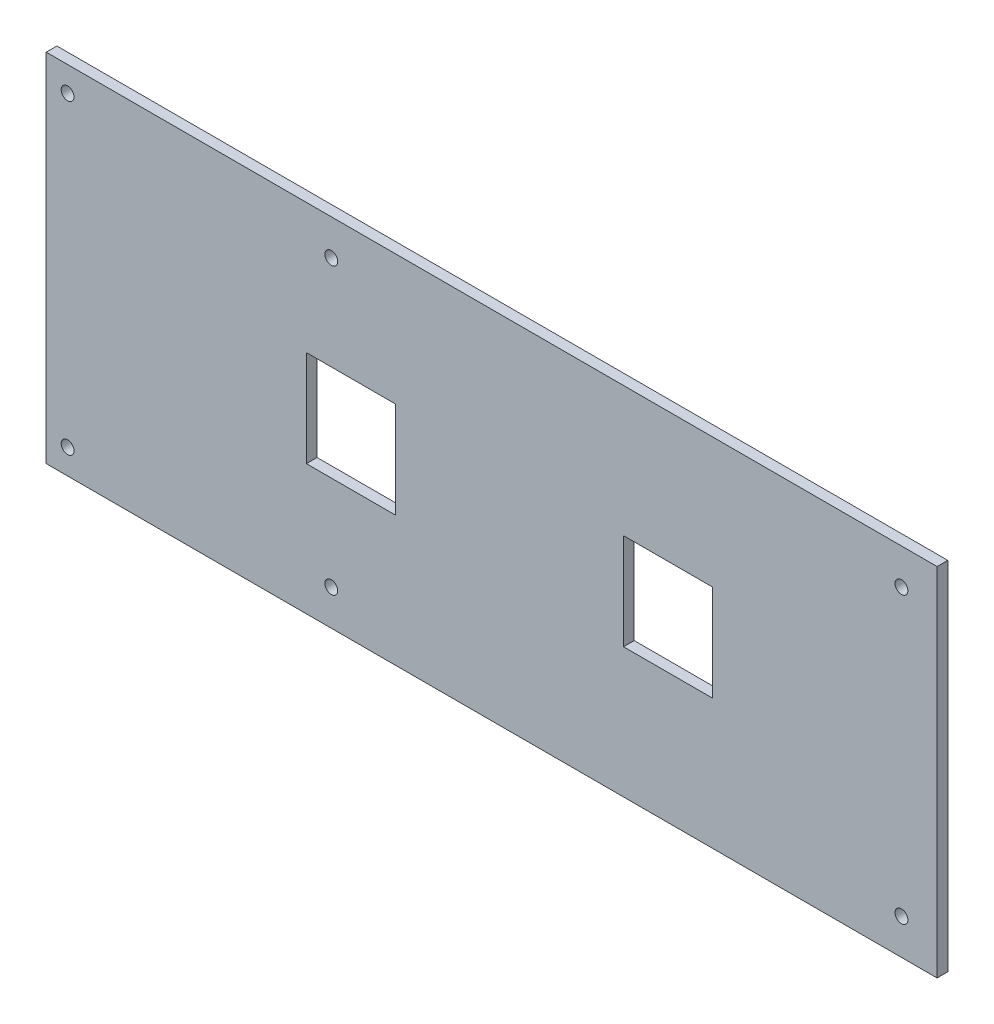
ISO-10303-21;
HEADER;
FILE_DESCRIPTION(('STEP AP214'),'2;1');
FILE_NAME('part.step','',(''),(''),'','','');
FILE_SCHEMA(('AUTOMOTIVE_DESIGN { 1 0 10303 214 1 1 1 1 }'));
ENDSEC;
DATA;
#1=APPLICATION_CONTEXT('core data for automotive mechanical design processes');
#2=APPLICATION_PROTOCOL_DEFINITION('international standard','automotive_design',2000,#1);
#3=PRODUCT_CONTEXT('',#1,'mechanical');
#4=PRODUCT('Part','Part','',(#3));
#5=PRODUCT_RELATED_PRODUCT_CATEGORY('part','',(#4));
#6=PRODUCT_DEFINITION_FORMATION('','',#4);
#7=PRODUCT_DEFINITION_CONTEXT('part definition',#1,'design');
#8=PRODUCT_DEFINITION('design','',#6,#7);
#9=PRODUCT_DEFINITION_SHAPE('','',#8);
#10=(LENGTH_UNIT() NAMED_UNIT(*) SI_UNIT(.MILLI.,.METRE.));
#11=(NAMED_UNIT(*) PLANE_ANGLE_UNIT() SI_UNIT($,.RADIAN.));
#12=(NAMED_UNIT(*) SI_UNIT($,.STERADIAN.) SOLID_ANGLE_UNIT());
#13=UNCERTAINTY_MEASURE_WITH_UNIT(LENGTH_MEASURE(1.E-05),#10,'distance_accuracy_value','');
#14=(GEOMETRIC_REPRESENTATION_CONTEXT(3) GLOBAL_UNCERTAINTY_ASSIGNED_CONTEXT((#13)) GLOBAL_UNIT_ASSIGNED_CONTEXT((#10,
#11,#12)) REPRESENTATION_CONTEXT('',''));
#15=CARTESIAN_POINT('',(0.,0.,0.));
#16=DIRECTION('',(0.,0.,1.));
#17=DIRECTION('',(1.,0.,0.));
#18=AXIS2_PLACEMENT_3D('',#15,#16,#17);
#19=CARTESIAN_POINT('',(0.,0.,3.));
#20=DIRECTION('',(1.,0.,0.));
#21=DIRECTION('',(0.,0.,-1.));
#22=AXIS2_PLACEMENT_3D('',#19,#20,#21);
#23=PLANE('',#22);
#24=DIRECTION('',(0.,-1.,0.));
#25=VECTOR('',#24,1.);
#26=CARTESIAN_POINT('',(0.,0.,0.));
#27=LINE('',#26,#25);
#28=CARTESIAN_POINT('',(0.,100.,0.));
#29=VERTEX_POINT('',#28);
#30=CARTESIAN_POINT('',(0.,0.,0.));
#31=VERTEX_POINT('',#30);
#32=EDGE_CURVE('E223',#29,#31,#27,.T.);
#33=ORIENTED_EDGE('',*,*,#32,.T.);
#34=DIRECTION('',(0.,0.,-1.));
#35=VECTOR('',#34,1.);
#36=CARTESIAN_POINT('',(0.,0.,3.));
#37=LINE('',#36,#35);
#38=CARTESIAN_POINT('',(0.,0.,3.));
#39=VERTEX_POINT('',#38);
#40=EDGE_CURVE('E11',#39,#31,#37,.T.);
#41=ORIENTED_EDGE('',*,*,#40,.F.);
#42=DIRECTION('',(0.,-1.,0.));
#43=VECTOR('',#42,1.);
#44=CARTESIAN_POINT('',(0.,0.,3.));
#45=LINE('',#44,#43);
#46=CARTESIAN_POINT('',(0.,100.,3.));
#47=VERTEX_POINT('',#46);
#48=EDGE_CURVE('E226',#47,#39,#45,.T.);
#49=ORIENTED_EDGE('',*,*,#48,.F.);
#50=DIRECTION('',(0.,0.,-1.));
#51=VECTOR('',#50,1.);
#52=CARTESIAN_POINT('',(0.,100.,3.));
#53=LINE('',#52,#51);
#54=EDGE_CURVE('E236',#47,#29,#53,.T.);
#55=ORIENTED_EDGE('',*,*,#54,.T.);
#56=EDGE_LOOP('',(#33,#41,#49,#55));
#57=FACE_BOUND('',#56,.T.);
#58=ADVANCED_FACE('F32',(#57),#23,.F.);
#59=CARTESIAN_POINT('',(0.,0.,3.));
#60=DIRECTION('',(0.,1.,0.));
#61=DIRECTION('',(0.,0.,1.));
#62=AXIS2_PLACEMENT_3D('',#59,#60,#61);
#63=PLANE('',#62);
#64=DIRECTION('',(1.,0.,0.));
#65=VECTOR('',#64,1.);
#66=CARTESIAN_POINT('',(0.,0.,0.));
#67=LINE('',#66,#65);
#68=CARTESIAN_POINT('',(250.,0.,0.));
#69=VERTEX_POINT('',#68);
#70=EDGE_CURVE('E239',#31,#69,#67,.T.);
#71=ORIENTED_EDGE('',*,*,#70,.T.);
#72=DIRECTION('',(0.,0.,-1.));
#73=VECTOR('',#72,1.);
#74=CARTESIAN_POINT('',(250.,0.,3.));
#75=LINE('',#74,#73);
#76=CARTESIAN_POINT('',(250.,0.,3.));
#77=VERTEX_POINT('',#76);
#78=EDGE_CURVE('E39',#77,#69,#75,.T.);
#79=ORIENTED_EDGE('',*,*,#78,.F.);
#80=DIRECTION('',(1.,0.,0.));
#81=VECTOR('',#80,1.);
#82=CARTESIAN_POINT('',(0.,0.,3.));
#83=LINE('',#82,#81);
#84=EDGE_CURVE('E229',#39,#77,#83,.T.);
#85=ORIENTED_EDGE('',*,*,#84,.F.);
#86=ORIENTED_EDGE('',*,*,#40,.T.);
#87=EDGE_LOOP('',(#71,#79,#85,#86));
#88=FACE_BOUND('',#87,.T.);
#89=ADVANCED_FACE('F268',(#88),#63,.F.);
#90=CARTESIAN_POINT('',(250.,0.,3.));
#91=DIRECTION('',(-1.,0.,0.));
#92=DIRECTION('',(0.,0.,1.));
#93=AXIS2_PLACEMENT_3D('',#90,#91,#92);
#94=PLANE('',#93);
#95=DIRECTION('',(0.,1.,0.));
#96=VECTOR('',#95,1.);
#97=CARTESIAN_POINT('',(250.,0.,0.));
#98=LINE('',#97,#96);
#99=CARTESIAN_POINT('',(250.,100.,0.));
#100=VERTEX_POINT('',#99);
#101=EDGE_CURVE('E241',#69,#100,#98,.T.);
#102=ORIENTED_EDGE('',*,*,#101,.T.);
#103=DIRECTION('',(0.,0.,-1.));
#104=VECTOR('',#103,1.);
#105=CARTESIAN_POINT('',(250.,100.,3.));
#106=LINE('',#105,#104);
#107=CARTESIAN_POINT('',(250.,100.,3.));
#108=VERTEX_POINT('',#107);
#109=EDGE_CURVE('E246',#108,#100,#106,.T.);
#110=ORIENTED_EDGE('',*,*,#109,.F.);
#111=DIRECTION('',(0.,1.,0.));
#112=VECTOR('',#111,1.);
#113=CARTESIAN_POINT('',(250.,0.,3.));
#114=LINE('',#113,#112);
#115=EDGE_CURVE('E232',#77,#108,#114,.T.);
#116=ORIENTED_EDGE('',*,*,#115,.F.);
#117=ORIENTED_EDGE('',*,*,#78,.T.);
#118=EDGE_LOOP('',(#102,#110,#116,#117));
#119=FACE_BOUND('',#118,.T.);
#120=ADVANCED_FACE('F253',(#119),#94,.F.);
#121=CARTESIAN_POINT('',(0.,100.,3.));
#122=DIRECTION('',(0.,-1.,0.));
#123=DIRECTION('',(0.,0.,-1.));
#124=AXIS2_PLACEMENT_3D('',#121,#122,#123);
#125=PLANE('',#124);
#126=DIRECTION('',(-1.,0.,0.));
#127=VECTOR('',#126,1.);
#128=CARTESIAN_POINT('',(0.,100.,0.));
#129=LINE('',#128,#127);
#130=EDGE_CURVE('E230',#100,#29,#129,.T.);
#131=ORIENTED_EDGE('',*,*,#130,.T.);
#132=ORIENTED_EDGE('',*,*,#54,.F.);
#133=DIRECTION('',(-1.,0.,0.));
#134=VECTOR('',#133,1.);
#135=CARTESIAN_POINT('',(0.,100.,3.));
#136=LINE('',#135,#134);
#137=EDGE_CURVE('E234',#108,#47,#136,.T.);
#138=ORIENTED_EDGE('',*,*,#137,.F.);
#139=ORIENTED_EDGE('',*,*,#109,.T.);
#140=EDGE_LOOP('',(#131,#132,#138,#139));
#141=FACE_BOUND('',#140,.T.);
#142=ADVANCED_FACE('F261',(#141),#125,.F.);
#143=CARTESIAN_POINT('',(0.,0.,3.));
#144=DIRECTION('',(0.,0.,-1.));
#145=DIRECTION('',(-1.,0.,0.));
#146=AXIS2_PLACEMENT_3D('',#143,#144,#145);
#147=PLANE('',#146);
#148=DIRECTION('',(1.,0.,0.));
#149=VECTOR('',#148,1.);
#150=CARTESIAN_POINT('',(73.,36.5,3.));
#151=LINE('',#150,#149);
#152=CARTESIAN_POINT('',(73.,36.5,3.));
#153=VERTEX_POINT('',#152);
#154=CARTESIAN_POINT('',(98.,36.5,3.));
#155=VERTEX_POINT('',#154);
#156=EDGE_CURVE('E150',#153,#155,#151,.T.);
#157=ORIENTED_EDGE('',*,*,#156,.F.);
#158=DIRECTION('',(0.,-1.,0.));
#159=VECTOR('',#158,1.);
#160=CARTESIAN_POINT('',(73.,63.5,3.));
#161=LINE('',#160,#159);
#162=CARTESIAN_POINT('',(73.,63.5,3.));
#163=VERTEX_POINT('',#162);
#164=EDGE_CURVE('E46',#163,#153,#161,.T.);
#165=ORIENTED_EDGE('',*,*,#164,.F.);
#166=DIRECTION('',(-1.,0.,0.));
#167=VECTOR('',#166,1.);
#168=CARTESIAN_POINT('',(73.,63.5,3.));
#169=LINE('',#168,#167);
#170=CARTESIAN_POINT('',(98.,63.5,3.));
#171=VERTEX_POINT('',#170);
#172=EDGE_CURVE('E141',#171,#163,#169,.T.);
#173=ORIENTED_EDGE('',*,*,#172,.F.);
#174=DIRECTION('',(0.,1.,0.));
#175=VECTOR('',#174,1.);
#176=CARTESIAN_POINT('',(98.,63.5,3.));
#177=LINE('',#176,#175);
#178=EDGE_CURVE('E144',#155,#171,#177,.T.);
#179=ORIENTED_EDGE('',*,*,#178,.F.);
#180=EDGE_LOOP('',(#157,#165,#173,#179));
#181=FACE_BOUND('',#180,.T.);
#182=DIRECTION('',(1.,0.,0.));
#183=VECTOR('',#182,1.);
#184=CARTESIAN_POINT('',(162.,36.5,3.));
#185=LINE('',#184,#183);
#186=CARTESIAN_POINT('',(162.,36.5,3.));
#187=VERTEX_POINT('',#186);
#188=CARTESIAN_POINT('',(187.,36.5,3.));
#189=VERTEX_POINT('',#188);
#190=EDGE_CURVE('E176',#187,#189,#185,.T.);
#191=ORIENTED_EDGE('',*,*,#190,.F.);
#192=DIRECTION('',(0.,-1.,0.));
#193=VECTOR('',#192,1.);
#194=CARTESIAN_POINT('',(162.,63.5,3.));
#195=LINE('',#194,#193);
#196=CARTESIAN_POINT('',(162.,63.5,3.));
#197=VERTEX_POINT('',#196);
#198=EDGE_CURVE('E54',#197,#187,#195,.T.);
#199=ORIENTED_EDGE('',*,*,#198,.F.);
#200=DIRECTION('',(-1.,0.,0.));
#201=VECTOR('',#200,1.);
#202=CARTESIAN_POINT('',(162.,63.5,3.));
#203=LINE('',#202,#201);
#204=CARTESIAN_POINT('',(187.,63.5,3.));
#205=VERTEX_POINT('',#204);
#206=EDGE_CURVE('E165',#205,#197,#203,.T.);
#207=ORIENTED_EDGE('',*,*,#206,.F.);
#208=DIRECTION('',(0.,1.,0.));
#209=VECTOR('',#208,1.);
#210=CARTESIAN_POINT('',(187.,63.5,3.));
#211=LINE('',#210,#209);
#212=EDGE_CURVE('E179',#189,#205,#211,.T.);
#213=ORIENTED_EDGE('',*,*,#212,.F.);
#214=EDGE_LOOP('',(#191,#199,#207,#213));
#215=FACE_BOUND('',#214,.T.);
#216=CARTESIAN_POINT('',(6.00000000000001,7.,3.));
#217=DIRECTION('',(0.,0.,1.));
#218=DIRECTION('',(1.,0.,0.));
#219=AXIS2_PLACEMENT_3D('',#216,#217,#218);
#220=CIRCLE('',#219,1.8);
#221=CARTESIAN_POINT('',(7.80000000000001,7.,3.));
#222=VERTEX_POINT('',#221);
#223=EDGE_CURVE('E157',#222,#222,#220,.T.);
#224=ORIENTED_EDGE('',*,*,#223,.F.);
#225=EDGE_LOOP('',(#224));
#226=FACE_BOUND('',#225,.T.);
#227=CARTESIAN_POINT('',(80.,10.,3.));
#228=DIRECTION('',(0.,0.,1.));
#229=DIRECTION('',(1.,0.,0.));
#230=AXIS2_PLACEMENT_3D('',#227,#228,#229);
#231=CIRCLE('',#230,1.79999999999999);
#232=CARTESIAN_POINT('',(81.8,10.,3.));
#233=VERTEX_POINT('',#232);
#234=EDGE_CURVE('E212',#233,#233,#231,.T.);
#235=ORIENTED_EDGE('',*,*,#234,.F.);
#236=EDGE_LOOP('',(#235));
#237=FACE_BOUND('',#236,.T.);
#238=CARTESIAN_POINT('',(240.,10.,3.));
#239=DIRECTION('',(0.,0.,1.));
#240=DIRECTION('',(1.,0.,0.));
#241=AXIS2_PLACEMENT_3D('',#238,#239,#240);
#242=CIRCLE('',#241,1.80000000000001);
#243=CARTESIAN_POINT('',(241.8,10.,3.));
#244=VERTEX_POINT('',#243);
#245=EDGE_CURVE('E206',#244,#244,#242,.T.);
#246=ORIENTED_EDGE('',*,*,#245,.F.);
#247=EDGE_LOOP('',(#246));
#248=FACE_BOUND('',#247,.T.);
#249=CARTESIAN_POINT('',(240.,90.,3.));
#250=DIRECTION('',(0.,0.,1.));
#251=DIRECTION('',(1.,0.,0.));
#252=AXIS2_PLACEMENT_3D('',#249,#250,#251);
#253=CIRCLE('',#252,1.80000000000001);
#254=CARTESIAN_POINT('',(241.8,90.,3.));
#255=VERTEX_POINT('',#254);
#256=EDGE_CURVE('E200',#255,#255,#253,.T.);
#257=ORIENTED_EDGE('',*,*,#256,.F.);
#258=EDGE_LOOP('',(#257));
#259=FACE_BOUND('',#258,.T.);
#260=CARTESIAN_POINT('',(80.,90.,3.));
#261=DIRECTION('',(0.,0.,1.));
#262=DIRECTION('',(1.,0.,0.));
#263=AXIS2_PLACEMENT_3D('',#260,#261,#262);
#264=CIRCLE('',#263,1.79999999999999);
#265=CARTESIAN_POINT('',(81.8,90.,3.));
#266=VERTEX_POINT('',#265);
#267=EDGE_CURVE('E194',#266,#266,#264,.T.);
#268=ORIENTED_EDGE('',*,*,#267,.F.);
#269=EDGE_LOOP('',(#268));
#270=FACE_BOUND('',#269,.T.);
#271=CARTESIAN_POINT('',(6.00000000000001,93.,3.));
#272=DIRECTION('',(0.,0.,1.));
#273=DIRECTION('',(1.,0.,0.));
#274=AXIS2_PLACEMENT_3D('',#271,#272,#273);
#275=CIRCLE('',#274,1.8);
#276=CARTESIAN_POINT('',(7.8,93.,3.));
#277=VERTEX_POINT('',#276);
#278=EDGE_CURVE('E193',#277,#277,#275,.T.);
#279=ORIENTED_EDGE('',*,*,#278,.F.);
#280=EDGE_LOOP('',(#279));
#281=FACE_BOUND('',#280,.T.);
#282=ORIENTED_EDGE('',*,*,#48,.T.);
#283=ORIENTED_EDGE('',*,*,#84,.T.);
#284=ORIENTED_EDGE('',*,*,#115,.T.);
#285=ORIENTED_EDGE('',*,*,#137,.T.);
#286=EDGE_LOOP('',(#282,#283,#284,#285));
#287=FACE_BOUND('',#286,.T.);
#288=ADVANCED_FACE('F267',(#181,#215,#226,#237,#248,#259,#270,#281,#287),#147,.F.);
#289=CARTESIAN_POINT('',(0.,0.,0.));
#290=DIRECTION('',(0.,0.,-1.));
#291=DIRECTION('',(-1.,0.,0.));
#292=AXIS2_PLACEMENT_3D('',#289,#290,#291);
#293=PLANE('',#292);
#294=DIRECTION('',(0.,-1.,0.));
#295=VECTOR('',#294,1.);
#296=CARTESIAN_POINT('',(73.,63.5,0.));
#297=LINE('',#296,#295);
#298=CARTESIAN_POINT('',(73.,63.5,0.));
#299=VERTEX_POINT('',#298);
#300=CARTESIAN_POINT('',(73.,36.5,0.));
#301=VERTEX_POINT('',#300);
#302=EDGE_CURVE('E122',#299,#301,#297,.T.);
#303=ORIENTED_EDGE('',*,*,#302,.T.);
#304=DIRECTION('',(1.,0.,0.));
#305=VECTOR('',#304,1.);
#306=CARTESIAN_POINT('',(73.,36.5,0.));
#307=LINE('',#306,#305);
#308=CARTESIAN_POINT('',(98.,36.5,0.));
#309=VERTEX_POINT('',#308);
#310=EDGE_CURVE('E132',#301,#309,#307,.T.);
#311=ORIENTED_EDGE('',*,*,#310,.T.);
#312=DIRECTION('',(0.,1.,0.));
#313=VECTOR('',#312,1.);
#314=CARTESIAN_POINT('',(98.,63.5,0.));
#315=LINE('',#314,#313);
#316=CARTESIAN_POINT('',(98.,63.5,0.));
#317=VERTEX_POINT('',#316);
#318=EDGE_CURVE('E136',#309,#317,#315,.T.);
#319=ORIENTED_EDGE('',*,*,#318,.T.);
#320=DIRECTION('',(-1.,0.,0.));
#321=VECTOR('',#320,1.);
#322=CARTESIAN_POINT('',(73.,63.5,0.));
#323=LINE('',#322,#321);
#324=EDGE_CURVE('E128',#317,#299,#323,.T.);
#325=ORIENTED_EDGE('',*,*,#324,.T.);
#326=EDGE_LOOP('',(#303,#311,#319,#325));
#327=FACE_BOUND('',#326,.T.);
#328=DIRECTION('',(0.,-1.,0.));
#329=VECTOR('',#328,1.);
#330=CARTESIAN_POINT('',(162.,63.5,0.));
#331=LINE('',#330,#329);
#332=CARTESIAN_POINT('',(162.,63.5,0.));
#333=VERTEX_POINT('',#332);
#334=CARTESIAN_POINT('',(162.,36.5,0.));
#335=VERTEX_POINT('',#334);
#336=EDGE_CURVE('E161',#333,#335,#331,.T.);
#337=ORIENTED_EDGE('',*,*,#336,.T.);
#338=DIRECTION('',(1.,0.,0.));
#339=VECTOR('',#338,1.);
#340=CARTESIAN_POINT('',(162.,36.5,0.));
#341=LINE('',#340,#339);
#342=CARTESIAN_POINT('',(187.,36.5,0.));
#343=VERTEX_POINT('',#342);
#344=EDGE_CURVE('E164',#335,#343,#341,.T.);
#345=ORIENTED_EDGE('',*,*,#344,.T.);
#346=DIRECTION('',(0.,1.,0.));
#347=VECTOR('',#346,1.);
#348=CARTESIAN_POINT('',(187.,63.5,0.));
#349=LINE('',#348,#347);
#350=CARTESIAN_POINT('',(187.,63.5,0.));
#351=VERTEX_POINT('',#350);
#352=EDGE_CURVE('E168',#343,#351,#349,.T.);
#353=ORIENTED_EDGE('',*,*,#352,.T.);
#354=DIRECTION('',(-1.,0.,0.));
#355=VECTOR('',#354,1.);
#356=CARTESIAN_POINT('',(162.,63.5,0.));
#357=LINE('',#356,#355);
#358=EDGE_CURVE('E171',#351,#333,#357,.T.);
#359=ORIENTED_EDGE('',*,*,#358,.T.);
#360=EDGE_LOOP('',(#337,#345,#353,#359));
#361=FACE_BOUND('',#360,.T.);
#362=CARTESIAN_POINT('',(6.00000000000001,7.,0.));
#363=DIRECTION('',(0.,0.,1.));
#364=DIRECTION('',(1.,0.,0.));
#365=AXIS2_PLACEMENT_3D('',#362,#363,#364);
#366=CIRCLE('',#365,1.8);
#367=CARTESIAN_POINT('',(7.80000000000001,7.,0.));
#368=VERTEX_POINT('',#367);
#369=EDGE_CURVE('E215',#368,#368,#366,.T.);
#370=ORIENTED_EDGE('',*,*,#369,.T.);
#371=EDGE_LOOP('',(#370));
#372=FACE_BOUND('',#371,.T.);
#373=CARTESIAN_POINT('',(80.,10.,0.));
#374=DIRECTION('',(0.,0.,1.));
#375=DIRECTION('',(1.,0.,0.));
#376=AXIS2_PLACEMENT_3D('',#373,#374,#375);
#377=CIRCLE('',#376,1.79999999999999);
#378=CARTESIAN_POINT('',(81.8,10.,0.));
#379=VERTEX_POINT('',#378);
#380=EDGE_CURVE('E209',#379,#379,#377,.T.);
#381=ORIENTED_EDGE('',*,*,#380,.T.);
#382=EDGE_LOOP('',(#381));
#383=FACE_BOUND('',#382,.T.);
#384=CARTESIAN_POINT('',(240.,10.,0.));
#385=DIRECTION('',(0.,0.,1.));
#386=DIRECTION('',(1.,0.,0.));
#387=AXIS2_PLACEMENT_3D('',#384,#385,#386);
#388=CIRCLE('',#387,1.80000000000001);
#389=CARTESIAN_POINT('',(241.8,10.,0.));
#390=VERTEX_POINT('',#389);
#391=EDGE_CURVE('E203',#390,#390,#388,.T.);
#392=ORIENTED_EDGE('',*,*,#391,.T.);
#393=EDGE_LOOP('',(#392));
#394=FACE_BOUND('',#393,.T.);
#395=CARTESIAN_POINT('',(240.,90.,0.));
#396=DIRECTION('',(0.,0.,1.));
#397=DIRECTION('',(1.,0.,0.));
#398=AXIS2_PLACEMENT_3D('',#395,#396,#397);
#399=CIRCLE('',#398,1.80000000000001);
#400=CARTESIAN_POINT('',(241.8,90.,0.));
#401=VERTEX_POINT('',#400);
#402=EDGE_CURVE('E197',#401,#401,#399,.T.);
#403=ORIENTED_EDGE('',*,*,#402,.T.);
#404=EDGE_LOOP('',(#403));
#405=FACE_BOUND('',#404,.T.);
#406=CARTESIAN_POINT('',(80.,90.,0.));
#407=DIRECTION('',(0.,0.,1.));
#408=DIRECTION('',(1.,0.,0.));
#409=AXIS2_PLACEMENT_3D('',#406,#407,#408);
#410=CIRCLE('',#409,1.79999999999999);
#411=CARTESIAN_POINT('',(81.8,90.,0.));
#412=VERTEX_POINT('',#411);
#413=EDGE_CURVE('E190',#412,#412,#410,.T.);
#414=ORIENTED_EDGE('',*,*,#413,.T.);
#415=EDGE_LOOP('',(#414));
#416=FACE_BOUND('',#415,.T.);
#417=CARTESIAN_POINT('',(6.00000000000001,93.,0.));
#418=DIRECTION('',(0.,0.,1.));
#419=DIRECTION('',(1.,0.,0.));
#420=AXIS2_PLACEMENT_3D('',#417,#418,#419);
#421=CIRCLE('',#420,1.8);
#422=CARTESIAN_POINT('',(7.8,93.,0.));
#423=VERTEX_POINT('',#422);
#424=EDGE_CURVE('E220',#423,#423,#421,.T.);
#425=ORIENTED_EDGE('',*,*,#424,.T.);
#426=EDGE_LOOP('',(#425));
#427=FACE_BOUND('',#426,.T.);
#428=ORIENTED_EDGE('',*,*,#32,.F.);
#429=ORIENTED_EDGE('',*,*,#130,.F.);
#430=ORIENTED_EDGE('',*,*,#101,.F.);
#431=ORIENTED_EDGE('',*,*,#70,.F.);
#432=EDGE_LOOP('',(#428,#429,#430,#431));
#433=FACE_BOUND('',#432,.T.);
#434=ADVANCED_FACE('F138',(#327,#361,#372,#383,#394,#405,#416,#427,#433),#293,.T.);
#435=CARTESIAN_POINT('',(6.00000000000001,93.,0.));
#436=DIRECTION('',(0.,0.,1.));
#437=DIRECTION('',(1.,0.,0.));
#438=AXIS2_PLACEMENT_3D('',#435,#436,#437);
#439=CYLINDRICAL_SURFACE('',#438,1.8);
#440=ORIENTED_EDGE('',*,*,#424,.F.);
#441=EDGE_LOOP('',(#440));
#442=FACE_BOUND('',#441,.T.);
#443=ORIENTED_EDGE('',*,*,#278,.T.);
#444=EDGE_LOOP('',(#443));
#445=FACE_BOUND('',#444,.T.);
#446=ADVANCED_FACE('F280',(#442,#445),#439,.F.);
#447=CARTESIAN_POINT('',(80.,90.,0.));
#448=DIRECTION('',(0.,0.,1.));
#449=DIRECTION('',(1.,0.,0.));
#450=AXIS2_PLACEMENT_3D('',#447,#448,#449);
#451=CYLINDRICAL_SURFACE('',#450,1.79999999999999);
#452=ORIENTED_EDGE('',*,*,#413,.F.);
#453=EDGE_LOOP('',(#452));
#454=FACE_BOUND('',#453,.T.);
#455=ORIENTED_EDGE('',*,*,#267,.T.);
#456=EDGE_LOOP('',(#455));
#457=FACE_BOUND('',#456,.T.);
#458=ADVANCED_FACE('F286',(#454,#457),#451,.F.);
#459=CARTESIAN_POINT('',(240.,90.,0.));
#460=DIRECTION('',(0.,0.,1.));
#461=DIRECTION('',(1.,0.,0.));
#462=AXIS2_PLACEMENT_3D('',#459,#460,#461);
#463=CYLINDRICAL_SURFACE('',#462,1.80000000000001);
#464=ORIENTED_EDGE('',*,*,#402,.F.);
#465=EDGE_LOOP('',(#464));
#466=FACE_BOUND('',#465,.T.);
#467=ORIENTED_EDGE('',*,*,#256,.T.);
#468=EDGE_LOOP('',(#467));
#469=FACE_BOUND('',#468,.T.);
#470=ADVANCED_FACE('F300',(#466,#469),#463,.F.);
#471=CARTESIAN_POINT('',(240.,10.,0.));
#472=DIRECTION('',(0.,0.,1.));
#473=DIRECTION('',(1.,0.,0.));
#474=AXIS2_PLACEMENT_3D('',#471,#472,#473);
#475=CYLINDRICAL_SURFACE('',#474,1.80000000000001);
#476=ORIENTED_EDGE('',*,*,#391,.F.);
#477=EDGE_LOOP('',(#476));
#478=FACE_BOUND('',#477,.T.);
#479=ORIENTED_EDGE('',*,*,#245,.T.);
#480=EDGE_LOOP('',(#479));
#481=FACE_BOUND('',#480,.T.);
#482=ADVANCED_FACE('F296',(#478,#481),#475,.F.);
#483=CARTESIAN_POINT('',(80.,10.,0.));
#484=DIRECTION('',(0.,0.,1.));
#485=DIRECTION('',(1.,0.,0.));
#486=AXIS2_PLACEMENT_3D('',#483,#484,#485);
#487=CYLINDRICAL_SURFACE('',#486,1.79999999999999);
#488=ORIENTED_EDGE('',*,*,#380,.F.);
#489=EDGE_LOOP('',(#488));
#490=FACE_BOUND('',#489,.T.);
#491=ORIENTED_EDGE('',*,*,#234,.T.);
#492=EDGE_LOOP('',(#491));
#493=FACE_BOUND('',#492,.T.);
#494=ADVANCED_FACE('F292',(#490,#493),#487,.F.);
#495=CARTESIAN_POINT('',(6.00000000000001,7.,0.));
#496=DIRECTION('',(0.,0.,1.));
#497=DIRECTION('',(1.,0.,0.));
#498=AXIS2_PLACEMENT_3D('',#495,#496,#497);
#499=CYLINDRICAL_SURFACE('',#498,1.8);
#500=ORIENTED_EDGE('',*,*,#369,.F.);
#501=EDGE_LOOP('',(#500));
#502=FACE_BOUND('',#501,.T.);
#503=ORIENTED_EDGE('',*,*,#223,.T.);
#504=EDGE_LOOP('',(#503));
#505=FACE_BOUND('',#504,.T.);
#506=ADVANCED_FACE('F288',(#502,#505),#499,.F.);
#507=CARTESIAN_POINT('',(162.,63.5,0.));
#508=DIRECTION('',(-1.,0.,0.));
#509=DIRECTION('',(0.,0.,1.));
#510=AXIS2_PLACEMENT_3D('',#507,#508,#509);
#511=PLANE('',#510);
#512=ORIENTED_EDGE('',*,*,#198,.T.);
#513=DIRECTION('',(0.,0.,1.));
#514=VECTOR('',#513,1.);
#515=CARTESIAN_POINT('',(162.,36.5,0.));
#516=LINE('',#515,#514);
#517=EDGE_CURVE('E174',#335,#187,#516,.T.);
#518=ORIENTED_EDGE('',*,*,#517,.F.);
#519=ORIENTED_EDGE('',*,*,#336,.F.);
#520=DIRECTION('',(0.,0.,1.));
#521=VECTOR('',#520,1.);
#522=CARTESIAN_POINT('',(162.,63.5,0.));
#523=LINE('',#522,#521);
#524=EDGE_CURVE('E151',#333,#197,#523,.T.);
#525=ORIENTED_EDGE('',*,*,#524,.T.);
#526=EDGE_LOOP('',(#512,#518,#519,#525));
#527=FACE_BOUND('',#526,.T.);
#528=ADVANCED_FACE('F291',(#527),#511,.F.);
#529=CARTESIAN_POINT('',(162.,63.5,0.));
#530=DIRECTION('',(0.,1.,0.));
#531=DIRECTION('',(0.,0.,1.));
#532=AXIS2_PLACEMENT_3D('',#529,#530,#531);
#533=PLANE('',#532);
#534=ORIENTED_EDGE('',*,*,#206,.T.);
#535=ORIENTED_EDGE('',*,*,#524,.F.);
#536=ORIENTED_EDGE('',*,*,#358,.F.);
#537=DIRECTION('',(0.,0.,1.));
#538=VECTOR('',#537,1.);
#539=CARTESIAN_POINT('',(187.,63.5,0.));
#540=LINE('',#539,#538);
#541=EDGE_CURVE('E185',#351,#205,#540,.T.);
#542=ORIENTED_EDGE('',*,*,#541,.T.);
#543=EDGE_LOOP('',(#534,#535,#536,#542));
#544=FACE_BOUND('',#543,.T.);
#545=ADVANCED_FACE('F310',(#544),#533,.F.);
#546=CARTESIAN_POINT('',(187.,63.5,0.));
#547=DIRECTION('',(1.,0.,0.));
#548=DIRECTION('',(0.,0.,-1.));
#549=AXIS2_PLACEMENT_3D('',#546,#547,#548);
#550=PLANE('',#549);
#551=ORIENTED_EDGE('',*,*,#212,.T.);
#552=ORIENTED_EDGE('',*,*,#541,.F.);
#553=ORIENTED_EDGE('',*,*,#352,.F.);
#554=DIRECTION('',(0.,0.,1.));
#555=VECTOR('',#554,1.);
#556=CARTESIAN_POINT('',(187.,36.5,0.));
#557=LINE('',#556,#555);
#558=EDGE_CURVE('E187',#343,#189,#557,.T.);
#559=ORIENTED_EDGE('',*,*,#558,.T.);
#560=EDGE_LOOP('',(#551,#552,#553,#559));
#561=FACE_BOUND('',#560,.T.);
#562=ADVANCED_FACE('F314',(#561),#550,.F.);
#563=CARTESIAN_POINT('',(162.,36.5,0.));
#564=DIRECTION('',(0.,-1.,0.));
#565=DIRECTION('',(0.,0.,-1.));
#566=AXIS2_PLACEMENT_3D('',#563,#564,#565);
#567=PLANE('',#566);
#568=ORIENTED_EDGE('',*,*,#190,.T.);
#569=ORIENTED_EDGE('',*,*,#558,.F.);
#570=ORIENTED_EDGE('',*,*,#344,.F.);
#571=ORIENTED_EDGE('',*,*,#517,.T.);
#572=EDGE_LOOP('',(#568,#569,#570,#571));
#573=FACE_BOUND('',#572,.T.);
#574=ADVANCED_FACE('F311',(#573),#567,.F.);
#575=CARTESIAN_POINT('',(73.,63.5,0.));
#576=DIRECTION('',(-1.,0.,0.));
#577=DIRECTION('',(0.,0.,1.));
#578=AXIS2_PLACEMENT_3D('',#575,#576,#577);
#579=PLANE('',#578);
#580=ORIENTED_EDGE('',*,*,#164,.T.);
#581=DIRECTION('',(0.,0.,1.));
#582=VECTOR('',#581,1.);
#583=CARTESIAN_POINT('',(73.,36.5,0.));
#584=LINE('',#583,#582);
#585=EDGE_CURVE('E118',#301,#153,#584,.T.);
#586=ORIENTED_EDGE('',*,*,#585,.F.);
#587=ORIENTED_EDGE('',*,*,#302,.F.);
#588=DIRECTION('',(0.,0.,1.));
#589=VECTOR('',#588,1.);
#590=CARTESIAN_POINT('',(73.,63.5,0.));
#591=LINE('',#590,#589);
#592=EDGE_CURVE('E155',#299,#163,#591,.T.);
#593=ORIENTED_EDGE('',*,*,#592,.T.);
#594=EDGE_LOOP('',(#580,#586,#587,#593));
#595=FACE_BOUND('',#594,.T.);
#596=ADVANCED_FACE('F120',(#595),#579,.F.);
#597=CARTESIAN_POINT('',(73.,63.5,0.));
#598=DIRECTION('',(0.,1.,0.));
#599=DIRECTION('',(0.,0.,1.));
#600=AXIS2_PLACEMENT_3D('',#597,#598,#599);
#601=PLANE('',#600);
#602=ORIENTED_EDGE('',*,*,#172,.T.);
#603=ORIENTED_EDGE('',*,*,#592,.F.);
#604=ORIENTED_EDGE('',*,*,#324,.F.);
#605=DIRECTION('',(0.,0.,1.));
#606=VECTOR('',#605,1.);
#607=CARTESIAN_POINT('',(98.,63.5,0.));
#608=LINE('',#607,#606);
#609=EDGE_CURVE('E158',#317,#171,#608,.T.);
#610=ORIENTED_EDGE('',*,*,#609,.T.);
#611=EDGE_LOOP('',(#602,#603,#604,#610));
#612=FACE_BOUND('',#611,.T.);
#613=ADVANCED_FACE('F324',(#612),#601,.F.);
#614=CARTESIAN_POINT('',(98.,63.5,0.));
#615=DIRECTION('',(1.,0.,0.));
#616=DIRECTION('',(0.,0.,-1.));
#617=AXIS2_PLACEMENT_3D('',#614,#615,#616);
#618=PLANE('',#617);
#619=ORIENTED_EDGE('',*,*,#178,.T.);
#620=ORIENTED_EDGE('',*,*,#609,.F.);
#621=ORIENTED_EDGE('',*,*,#318,.F.);
#622=DIRECTION('',(0.,0.,1.));
#623=VECTOR('',#622,1.);
#624=CARTESIAN_POINT('',(98.,36.5,0.));
#625=LINE('',#624,#623);
#626=EDGE_CURVE('E127',#309,#155,#625,.T.);
#627=ORIENTED_EDGE('',*,*,#626,.T.);
#628=EDGE_LOOP('',(#619,#620,#621,#627));
#629=FACE_BOUND('',#628,.T.);
#630=ADVANCED_FACE('F327',(#629),#618,.F.);
#631=CARTESIAN_POINT('',(73.,36.5,0.));
#632=DIRECTION('',(0.,-1.,0.));
#633=DIRECTION('',(0.,0.,-1.));
#634=AXIS2_PLACEMENT_3D('',#631,#632,#633);
#635=PLANE('',#634);
#636=ORIENTED_EDGE('',*,*,#156,.T.);
#637=ORIENTED_EDGE('',*,*,#626,.F.);
#638=ORIENTED_EDGE('',*,*,#310,.F.);
#639=ORIENTED_EDGE('',*,*,#585,.T.);
#640=EDGE_LOOP('',(#636,#637,#638,#639));
#641=FACE_BOUND('',#640,.T.);
#642=ADVANCED_FACE('F133',(#641),#635,.F.);
#643=CLOSED_SHELL('',(#58,#89,#120,#142,#288,#434,#446,#458,#470,#482,#494,#506,#528,#545,#562,
#574,#596,#613,#630,#642));
#644=MANIFOLD_SOLID_BREP('B2',#643);
#645=ADVANCED_BREP_SHAPE_REPRESENTATION('',(#18,#644),#14);
#646=SHAPE_DEFINITION_REPRESENTATION(#9,#645);
ENDSEC;
END-ISO-10303-21;
